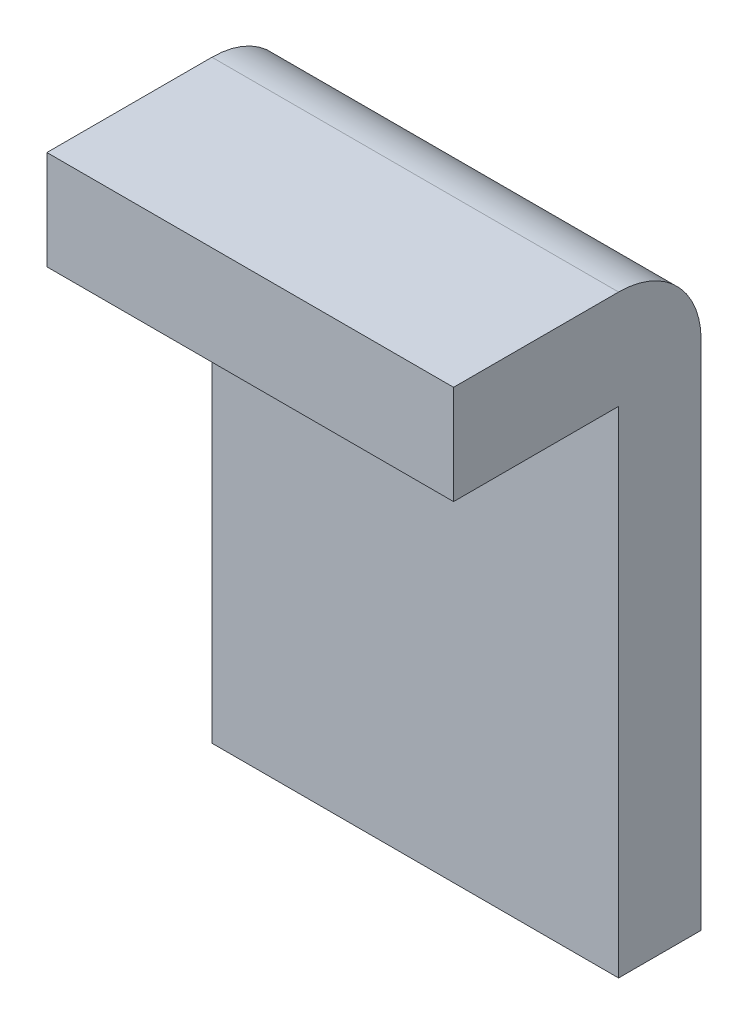
ISO-10303-21;
HEADER;
FILE_DESCRIPTION(('STEP AP214'),'2;1');
FILE_NAME('part.step','',(''),(''),'','','');
FILE_SCHEMA(('AUTOMOTIVE_DESIGN { 1 0 10303 214 1 1 1 1 }'));
ENDSEC;
DATA;
#1=APPLICATION_CONTEXT('core data for automotive mechanical design processes');
#2=APPLICATION_PROTOCOL_DEFINITION('international standard','automotive_design',2000,#1);
#3=PRODUCT_CONTEXT('',#1,'mechanical');
#4=PRODUCT('Part','Part','',(#3));
#5=PRODUCT_RELATED_PRODUCT_CATEGORY('part','',(#4));
#6=PRODUCT_DEFINITION_FORMATION('','',#4);
#7=PRODUCT_DEFINITION_CONTEXT('part definition',#1,'design');
#8=PRODUCT_DEFINITION('design','',#6,#7);
#9=PRODUCT_DEFINITION_SHAPE('','',#8);
#10=(LENGTH_UNIT() NAMED_UNIT(*) SI_UNIT(.MILLI.,.METRE.));
#11=(NAMED_UNIT(*) PLANE_ANGLE_UNIT() SI_UNIT($,.RADIAN.));
#12=(NAMED_UNIT(*) SI_UNIT($,.STERADIAN.) SOLID_ANGLE_UNIT());
#13=UNCERTAINTY_MEASURE_WITH_UNIT(LENGTH_MEASURE(1.E-05),#10,'distance_accuracy_value','');
#14=(GEOMETRIC_REPRESENTATION_CONTEXT(3) GLOBAL_UNCERTAINTY_ASSIGNED_CONTEXT((#13)) GLOBAL_UNIT_ASSIGNED_CONTEXT((#10,
#11,#12)) REPRESENTATION_CONTEXT('',''));
#15=CARTESIAN_POINT('',(0.,0.,0.));
#16=DIRECTION('',(0.,0.,1.));
#17=DIRECTION('',(1.,0.,0.));
#18=AXIS2_PLACEMENT_3D('',#15,#16,#17);
#19=CARTESIAN_POINT('',(-8.34906661620967,8.30000000000001,4.25467377707551));
#20=DIRECTION('',(0.,1.,0.));
#21=DIRECTION('',(0.,0.,1.));
#22=AXIS2_PLACEMENT_3D('',#19,#20,#21);
#23=PLANE('',#22);
#24=DIRECTION('',(1.,0.,0.));
#25=VECTOR('',#24,1.);
#26=CARTESIAN_POINT('',(21.709066144855,8.30000000000001,4.25467377707551));
#27=LINE('',#26,#25);
#28=CARTESIAN_POINT('',(21.709066144855,8.30000000000001,4.25467377707551));
#29=VERTEX_POINT('',#28);
#30=CARTESIAN_POINT('',(22.9412169012958,8.30000000000001,4.25467377707551));
#31=VERTEX_POINT('',#30);
#32=EDGE_CURVE('E133',#29,#31,#27,.T.);
#33=ORIENTED_EDGE('',*,*,#32,.F.);
#34=DIRECTION('',(0.,0.,1.));
#35=VECTOR('',#34,1.);
#36=CARTESIAN_POINT('',(21.709066144855,8.30000000000001,4.25467377707552));
#37=LINE('',#36,#35);
#38=CARTESIAN_POINT('',(21.709066144855,8.30000000000001,3.75467377707551));
#39=VERTEX_POINT('',#38);
#40=EDGE_CURVE('E113',#39,#29,#37,.T.);
#41=ORIENTED_EDGE('',*,*,#40,.F.);
#42=DIRECTION('',(1.,0.,0.));
#43=VECTOR('',#42,1.);
#44=CARTESIAN_POINT('',(-8.34906661620967,8.30000000000001,3.75467377707551));
#45=LINE('',#44,#43);
#46=CARTESIAN_POINT('',(22.9412169012958,8.30000000000001,3.75467377707551));
#47=VERTEX_POINT('',#46);
#48=EDGE_CURVE('E130',#39,#47,#45,.T.);
#49=ORIENTED_EDGE('',*,*,#48,.T.);
#50=DIRECTION('',(0.,0.,-1.));
#51=VECTOR('',#50,1.);
#52=CARTESIAN_POINT('',(22.9412169012958,8.30000000000001,4.25467377707552));
#53=LINE('',#52,#51);
#54=EDGE_CURVE('E129',#31,#47,#53,.T.);
#55=ORIENTED_EDGE('',*,*,#54,.F.);
#56=EDGE_LOOP('',(#33,#41,#49,#55));
#57=FACE_BOUND('',#56,.T.);
#58=ADVANCED_FACE('F17',(#57),#23,.F.);
#59=CARTESIAN_POINT('',(21.709066144855,5.35753839337144,4.25467377707552));
#60=DIRECTION('',(0.,0.,1.));
#61=DIRECTION('',(0.,-1.,0.));
#62=AXIS2_PLACEMENT_3D('',#59,#60,#61);
#63=PLANE('',#62);
#64=DIRECTION('',(1.,0.,0.));
#65=VECTOR('',#64,1.);
#66=CARTESIAN_POINT('',(-8.34906661620967,8.6,4.25467377707551));
#67=LINE('',#66,#65);
#68=CARTESIAN_POINT('',(22.9412169012958,8.6,4.25467377707551));
#69=VERTEX_POINT('',#68);
#70=CARTESIAN_POINT('',(21.709066144855,8.6,4.25467377707551));
#71=VERTEX_POINT('',#70);
#72=EDGE_CURVE('E131',#69,#71,#67,.F.);
#73=ORIENTED_EDGE('',*,*,#72,.T.);
#74=DIRECTION('',(0.,1.,0.));
#75=VECTOR('',#74,1.);
#76=CARTESIAN_POINT('',(21.709066144855,5.35753839337144,4.25467377707551));
#77=LINE('',#76,#75);
#78=EDGE_CURVE('E136',#29,#71,#77,.T.);
#79=ORIENTED_EDGE('',*,*,#78,.F.);
#80=ORIENTED_EDGE('',*,*,#32,.T.);
#81=DIRECTION('',(0.,1.,0.));
#82=VECTOR('',#81,1.);
#83=CARTESIAN_POINT('',(22.9412169012958,5.35753839337144,4.25467377707551));
#84=LINE('',#83,#82);
#85=EDGE_CURVE('E120',#69,#31,#84,.F.);
#86=ORIENTED_EDGE('',*,*,#85,.F.);
#87=EDGE_LOOP('',(#73,#79,#80,#86));
#88=FACE_BOUND('',#87,.T.);
#89=ADVANCED_FACE('F172',(#88),#63,.T.);
#90=CARTESIAN_POINT('',(-8.34906661620967,8.6,4.25467377707551));
#91=DIRECTION('',(0.,-1.,0.));
#92=DIRECTION('',(0.,0.,-1.));
#93=AXIS2_PLACEMENT_3D('',#90,#91,#92);
#94=PLANE('',#93);
#95=DIRECTION('',(1.,0.,0.));
#96=VECTOR('',#95,1.);
#97=CARTESIAN_POINT('',(-8.34906661620967,8.6,3.75467377707551));
#98=LINE('',#97,#96);
#99=CARTESIAN_POINT('',(21.709066144855,8.6,3.7546737770755));
#100=VERTEX_POINT('',#99);
#101=CARTESIAN_POINT('',(22.9412169012958,8.6,3.7546737770755));
#102=VERTEX_POINT('',#101);
#103=EDGE_CURVE('E79',#100,#102,#98,.T.);
#104=ORIENTED_EDGE('',*,*,#103,.F.);
#105=DIRECTION('',(0.,0.,1.));
#106=VECTOR('',#105,1.);
#107=CARTESIAN_POINT('',(21.709066144855,8.6,4.25467377707552));
#108=LINE('',#107,#106);
#109=EDGE_CURVE('E139',#71,#100,#108,.F.);
#110=ORIENTED_EDGE('',*,*,#109,.F.);
#111=ORIENTED_EDGE('',*,*,#72,.F.);
#112=DIRECTION('',(0.,0.,-1.));
#113=VECTOR('',#112,1.);
#114=CARTESIAN_POINT('',(22.9412169012958,8.6,4.25467377707552));
#115=LINE('',#114,#113);
#116=EDGE_CURVE('E83',#102,#69,#115,.F.);
#117=ORIENTED_EDGE('',*,*,#116,.F.);
#118=EDGE_LOOP('',(#104,#110,#111,#117));
#119=FACE_BOUND('',#118,.T.);
#120=ADVANCED_FACE('F169',(#119),#94,.F.);
#121=CARTESIAN_POINT('',(-8.34906661620967,8.30000000000001,3.75467377707551));
#122=DIRECTION('',(0.,0.,-1.));
#123=DIRECTION('',(0.,1.,0.));
#124=AXIS2_PLACEMENT_3D('',#121,#122,#123);
#125=PLANE('',#124);
#126=ORIENTED_EDGE('',*,*,#48,.F.);
#127=DIRECTION('',(0.,1.,0.));
#128=VECTOR('',#127,1.);
#129=CARTESIAN_POINT('',(21.709066144855,5.35753839337144,3.75467377707551));
#130=LINE('',#129,#128);
#131=CARTESIAN_POINT('',(21.709066144855,6.8,3.75467377707551));
#132=VERTEX_POINT('',#131);
#133=EDGE_CURVE('E95',#132,#39,#130,.T.);
#134=ORIENTED_EDGE('',*,*,#133,.F.);
#135=DIRECTION('',(1.,0.,0.));
#136=VECTOR('',#135,1.);
#137=CARTESIAN_POINT('',(-15.8147962412963,6.8,3.75467377707551));
#138=LINE('',#137,#136);
#139=CARTESIAN_POINT('',(22.9412169012958,6.8,3.75467377707551));
#140=VERTEX_POINT('',#139);
#141=EDGE_CURVE('E114',#140,#132,#138,.F.);
#142=ORIENTED_EDGE('',*,*,#141,.F.);
#143=DIRECTION('',(0.,1.,0.));
#144=VECTOR('',#143,1.);
#145=CARTESIAN_POINT('',(22.9412169012958,5.35753839337144,3.75467377707551));
#146=LINE('',#145,#144);
#147=EDGE_CURVE('E84',#47,#140,#146,.F.);
#148=ORIENTED_EDGE('',*,*,#147,.F.);
#149=EDGE_LOOP('',(#126,#134,#142,#148));
#150=FACE_BOUND('',#149,.T.);
#151=ADVANCED_FACE('F178',(#150),#125,.F.);
#152=CARTESIAN_POINT('',(-8.34906661620967,8.35,3.7546737770755));
#153=DIRECTION('',(1.,0.,0.));
#154=DIRECTION('',(0.,0.,-1.));
#155=AXIS2_PLACEMENT_3D('',#152,#153,#154);
#156=CYLINDRICAL_SURFACE('',#155,0.249999999999996);
#157=CARTESIAN_POINT('',(21.709066144855,8.35,3.7546737770755));
#158=DIRECTION('',(1.,0.,0.));
#159=DIRECTION('',(0.,0.,-1.));
#160=AXIS2_PLACEMENT_3D('',#157,#158,#159);
#161=CIRCLE('',#160,0.249999999999996);
#162=CARTESIAN_POINT('',(21.709066144855,8.35,3.50467377707551));
#163=VERTEX_POINT('',#162);
#164=EDGE_CURVE('E106',#100,#163,#161,.F.);
#165=ORIENTED_EDGE('',*,*,#164,.F.);
#166=ORIENTED_EDGE('',*,*,#103,.T.);
#167=CARTESIAN_POINT('',(22.9412169012957,8.35,3.7546737770755));
#168=DIRECTION('',(1.,0.,0.));
#169=DIRECTION('',(0.,0.,-1.));
#170=AXIS2_PLACEMENT_3D('',#167,#168,#169);
#171=CIRCLE('',#170,0.249999999999996);
#172=CARTESIAN_POINT('',(22.9412169012957,8.35,3.50467377707551));
#173=VERTEX_POINT('',#172);
#174=EDGE_CURVE('E20',#173,#102,#171,.T.);
#175=ORIENTED_EDGE('',*,*,#174,.F.);
#176=DIRECTION('',(1.,0.,0.));
#177=VECTOR('',#176,1.);
#178=CARTESIAN_POINT('',(21.709066144855,8.35,3.50467377707551));
#179=LINE('',#178,#177);
#180=EDGE_CURVE('E77',#163,#173,#179,.T.);
#181=ORIENTED_EDGE('',*,*,#180,.F.);
#182=EDGE_LOOP('',(#165,#166,#175,#181));
#183=FACE_BOUND('',#182,.T.);
#184=ADVANCED_FACE('F75',(#183),#156,.T.);
#185=CARTESIAN_POINT('',(22.9412169012958,5.35753839337144,4.25467377707552));
#186=DIRECTION('',(1.,0.,0.));
#187=DIRECTION('',(0.,0.,-1.));
#188=AXIS2_PLACEMENT_3D('',#185,#186,#187);
#189=PLANE('',#188);
#190=ORIENTED_EDGE('',*,*,#116,.T.);
#191=ORIENTED_EDGE('',*,*,#85,.T.);
#192=ORIENTED_EDGE('',*,*,#54,.T.);
#193=ORIENTED_EDGE('',*,*,#147,.T.);
#194=DIRECTION('',(0.,0.,-1.));
#195=VECTOR('',#194,1.);
#196=CARTESIAN_POINT('',(22.9412169012958,6.80000000000003,12.5046737770755));
#197=LINE('',#196,#195);
#198=CARTESIAN_POINT('',(22.9412169012957,6.8,3.50467377707552));
#199=VERTEX_POINT('',#198);
#200=EDGE_CURVE('E90',#199,#140,#197,.F.);
#201=ORIENTED_EDGE('',*,*,#200,.F.);
#202=DIRECTION('',(0.,1.,0.));
#203=VECTOR('',#202,1.);
#204=CARTESIAN_POINT('',(22.9412169012957,5.35753839337143,3.50467377707552));
#205=LINE('',#204,#203);
#206=EDGE_CURVE('E86',#173,#199,#205,.F.);
#207=ORIENTED_EDGE('',*,*,#206,.F.);
#208=ORIENTED_EDGE('',*,*,#174,.T.);
#209=EDGE_LOOP('',(#190,#191,#192,#193,#201,#207,#208));
#210=FACE_BOUND('',#209,.T.);
#211=ADVANCED_FACE('F87',(#210),#189,.T.);
#212=CARTESIAN_POINT('',(-15.8147962412963,6.80000000000003,12.5046737770755));
#213=DIRECTION('',(0.,-1.,0.));
#214=DIRECTION('',(0.,0.,-1.));
#215=AXIS2_PLACEMENT_3D('',#212,#213,#214);
#216=PLANE('',#215);
#217=DIRECTION('',(1.,0.,0.));
#218=VECTOR('',#217,1.);
#219=CARTESIAN_POINT('',(21.709066144855,6.8,3.50467377707552));
#220=LINE('',#219,#218);
#221=CARTESIAN_POINT('',(21.709066144855,6.8,3.50467377707552));
#222=VERTEX_POINT('',#221);
#223=EDGE_CURVE('E26',#199,#222,#220,.F.);
#224=ORIENTED_EDGE('',*,*,#223,.F.);
#225=ORIENTED_EDGE('',*,*,#200,.T.);
#226=ORIENTED_EDGE('',*,*,#141,.T.);
#227=DIRECTION('',(0.,0.,1.));
#228=VECTOR('',#227,1.);
#229=CARTESIAN_POINT('',(21.709066144855,6.8,4.25467377707552));
#230=LINE('',#229,#228);
#231=EDGE_CURVE('E35',#222,#132,#230,.T.);
#232=ORIENTED_EDGE('',*,*,#231,.F.);
#233=EDGE_LOOP('',(#224,#225,#226,#232));
#234=FACE_BOUND('',#233,.T.);
#235=ADVANCED_FACE('F179',(#234),#216,.T.);
#236=CARTESIAN_POINT('',(21.709066144855,5.35753839337144,4.25467377707552));
#237=DIRECTION('',(-1.,0.,0.));
#238=DIRECTION('',(0.,0.,1.));
#239=AXIS2_PLACEMENT_3D('',#236,#237,#238);
#240=PLANE('',#239);
#241=ORIENTED_EDGE('',*,*,#231,.T.);
#242=ORIENTED_EDGE('',*,*,#133,.T.);
#243=ORIENTED_EDGE('',*,*,#40,.T.);
#244=ORIENTED_EDGE('',*,*,#78,.T.);
#245=ORIENTED_EDGE('',*,*,#109,.T.);
#246=ORIENTED_EDGE('',*,*,#164,.T.);
#247=DIRECTION('',(0.,1.,0.));
#248=VECTOR('',#247,1.);
#249=CARTESIAN_POINT('',(21.709066144855,5.35753839337143,3.50467377707552));
#250=LINE('',#249,#248);
#251=EDGE_CURVE('E11',#222,#163,#250,.T.);
#252=ORIENTED_EDGE('',*,*,#251,.F.);
#253=EDGE_LOOP('',(#241,#242,#243,#244,#245,#246,#252));
#254=FACE_BOUND('',#253,.T.);
#255=ADVANCED_FACE('F166',(#254),#240,.T.);
#256=CARTESIAN_POINT('',(21.709066144855,5.35753839337143,3.50467377707552));
#257=DIRECTION('',(0.,0.,-1.));
#258=DIRECTION('',(0.,1.,0.));
#259=AXIS2_PLACEMENT_3D('',#256,#257,#258);
#260=PLANE('',#259);
#261=ORIENTED_EDGE('',*,*,#223,.T.);
#262=ORIENTED_EDGE('',*,*,#251,.T.);
#263=ORIENTED_EDGE('',*,*,#180,.T.);
#264=ORIENTED_EDGE('',*,*,#206,.T.);
#265=EDGE_LOOP('',(#261,#262,#263,#264));
#266=FACE_BOUND('',#265,.T.);
#267=ADVANCED_FACE('F94',(#266),#260,.T.);
#268=CLOSED_SHELL('',(#58,#89,#120,#151,#184,#211,#235,#255,#267));
#269=MANIFOLD_SOLID_BREP('B1',#268);
#270=ADVANCED_BREP_SHAPE_REPRESENTATION('',(#18,#269),#14);
#271=SHAPE_DEFINITION_REPRESENTATION(#9,#270);
ENDSEC;
END-ISO-10303-21;
